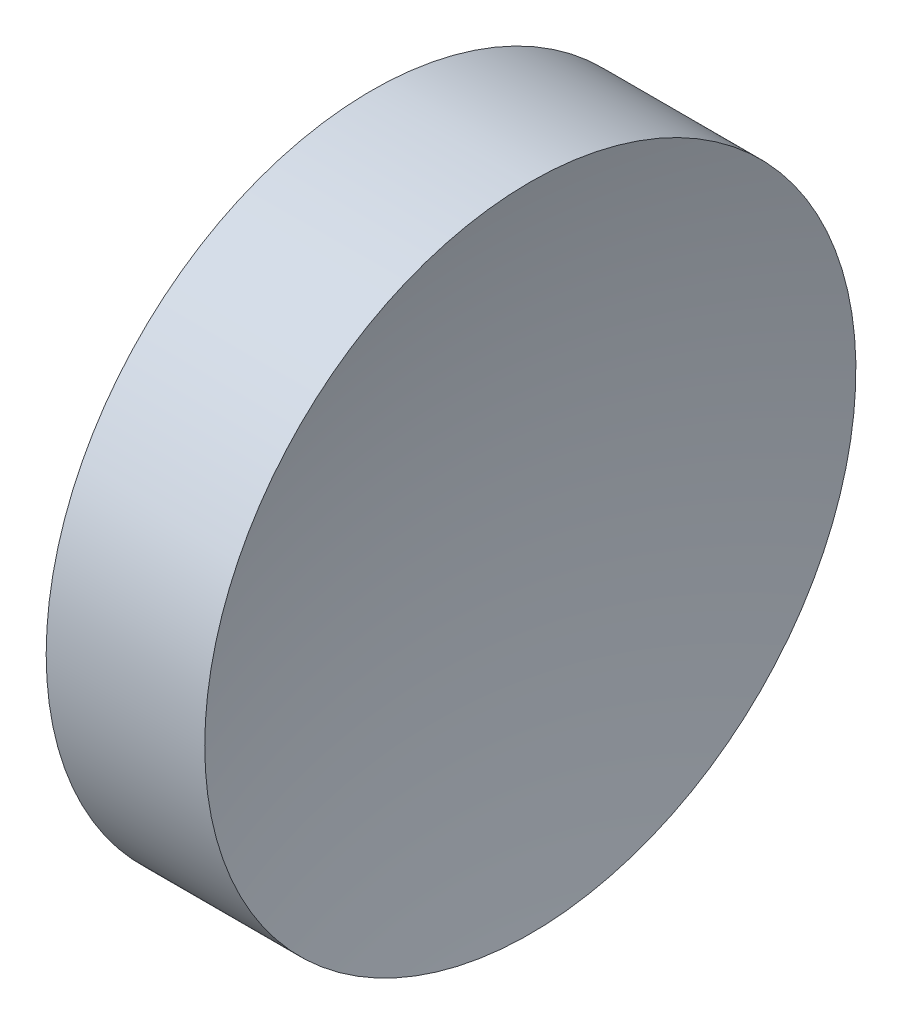
ISO-10303-21;
HEADER;
FILE_DESCRIPTION(('STEP AP214'),'2;1');
FILE_NAME('part.step','',(''),(''),'','','');
FILE_SCHEMA(('AUTOMOTIVE_DESIGN { 1 0 10303 214 1 1 1 1 }'));
ENDSEC;
DATA;
#1=APPLICATION_CONTEXT('core data for automotive mechanical design processes');
#2=APPLICATION_PROTOCOL_DEFINITION('international standard','automotive_design',2000,#1);
#3=PRODUCT_CONTEXT('',#1,'mechanical');
#4=PRODUCT('Part','Part','',(#3));
#5=PRODUCT_RELATED_PRODUCT_CATEGORY('part','',(#4));
#6=PRODUCT_DEFINITION_FORMATION('','',#4);
#7=PRODUCT_DEFINITION_CONTEXT('part definition',#1,'design');
#8=PRODUCT_DEFINITION('design','',#6,#7);
#9=PRODUCT_DEFINITION_SHAPE('','',#8);
#10=(LENGTH_UNIT() NAMED_UNIT(*) SI_UNIT(.MILLI.,.METRE.));
#11=(NAMED_UNIT(*) PLANE_ANGLE_UNIT() SI_UNIT($,.RADIAN.));
#12=(NAMED_UNIT(*) SI_UNIT($,.STERADIAN.) SOLID_ANGLE_UNIT());
#13=UNCERTAINTY_MEASURE_WITH_UNIT(LENGTH_MEASURE(1.E-05),#10,'distance_accuracy_value','');
#14=(GEOMETRIC_REPRESENTATION_CONTEXT(3) GLOBAL_UNCERTAINTY_ASSIGNED_CONTEXT((#13)) GLOBAL_UNIT_ASSIGNED_CONTEXT((#10,
#11,#12)) REPRESENTATION_CONTEXT('',''));
#15=CARTESIAN_POINT('',(0.,0.,0.));
#16=DIRECTION('',(0.,0.,1.));
#17=DIRECTION('',(1.,0.,0.));
#18=AXIS2_PLACEMENT_3D('',#15,#16,#17);
#19=CARTESIAN_POINT('',(339.185311069839,138.756042246745,0.));
#20=DIRECTION('',(-1.,0.,0.));
#21=DIRECTION('',(0.,1.,0.));
#22=AXIS2_PLACEMENT_3D('',#19,#20,#21);
#23=SPHERICAL_SURFACE('',#22,100.);
#24=CARTESIAN_POINT('',(242.360727414654,138.756042246745,0.));
#25=DIRECTION('',(-1.,0.,0.));
#26=DIRECTION('',(0.,0.,1.));
#27=AXIS2_PLACEMENT_3D('',#24,#25,#26);
#28=CIRCLE('',#27,25.);
#29=CARTESIAN_POINT('',(242.360727414654,138.756042246745,25.));
#30=VERTEX_POINT('',#29);
#31=EDGE_CURVE('E10',#30,#30,#28,.T.);
#32=ORIENTED_EDGE('',*,*,#31,.F.);
#33=EDGE_LOOP('',(#32));
#34=FACE_BOUND('',#33,.T.);
#35=ADVANCED_FACE('F35',(#34),#23,.F.);
#36=CARTESIAN_POINT('',(217.97028600433,138.756042246745,0.));
#37=DIRECTION('',(-1.,0.,0.));
#38=DIRECTION('',(0.,0.,1.));
#39=AXIS2_PLACEMENT_3D('',#36,#37,#38);
#40=CYLINDRICAL_SURFACE('',#39,25.);
#41=CARTESIAN_POINT('',(230.185311069839,138.756042246745,0.));
#42=DIRECTION('',(-1.,0.,0.));
#43=DIRECTION('',(0.,0.,1.));
#44=AXIS2_PLACEMENT_3D('',#41,#42,#43);
#45=CIRCLE('',#44,25.);
#46=CARTESIAN_POINT('',(230.185311069839,138.756042246745,25.));
#47=VERTEX_POINT('',#46);
#48=EDGE_CURVE('E41',#47,#47,#45,.T.);
#49=ORIENTED_EDGE('',*,*,#48,.F.);
#50=EDGE_LOOP('',(#49));
#51=FACE_BOUND('',#50,.T.);
#52=ORIENTED_EDGE('',*,*,#31,.T.);
#53=EDGE_LOOP('',(#52));
#54=FACE_BOUND('',#53,.T.);
#55=ADVANCED_FACE('F49',(#51,#54),#40,.T.);
#56=CARTESIAN_POINT('',(230.185311069839,138.756042246745,0.));
#57=DIRECTION('',(1.,0.,0.));
#58=DIRECTION('',(0.,0.,-1.));
#59=AXIS2_PLACEMENT_3D('',#56,#57,#58);
#60=PLANE('',#59);
#61=ORIENTED_EDGE('',*,*,#48,.T.);
#62=EDGE_LOOP('',(#61));
#63=FACE_BOUND('',#62,.T.);
#64=ADVANCED_FACE('F47',(#63),#60,.F.);
#65=CLOSED_SHELL('',(#35,#55,#64));
#66=MANIFOLD_SOLID_BREP('B2',#65);
#67=ADVANCED_BREP_SHAPE_REPRESENTATION('',(#18,#66),#14);
#68=SHAPE_DEFINITION_REPRESENTATION(#9,#67);
ENDSEC;
END-ISO-10303-21;
